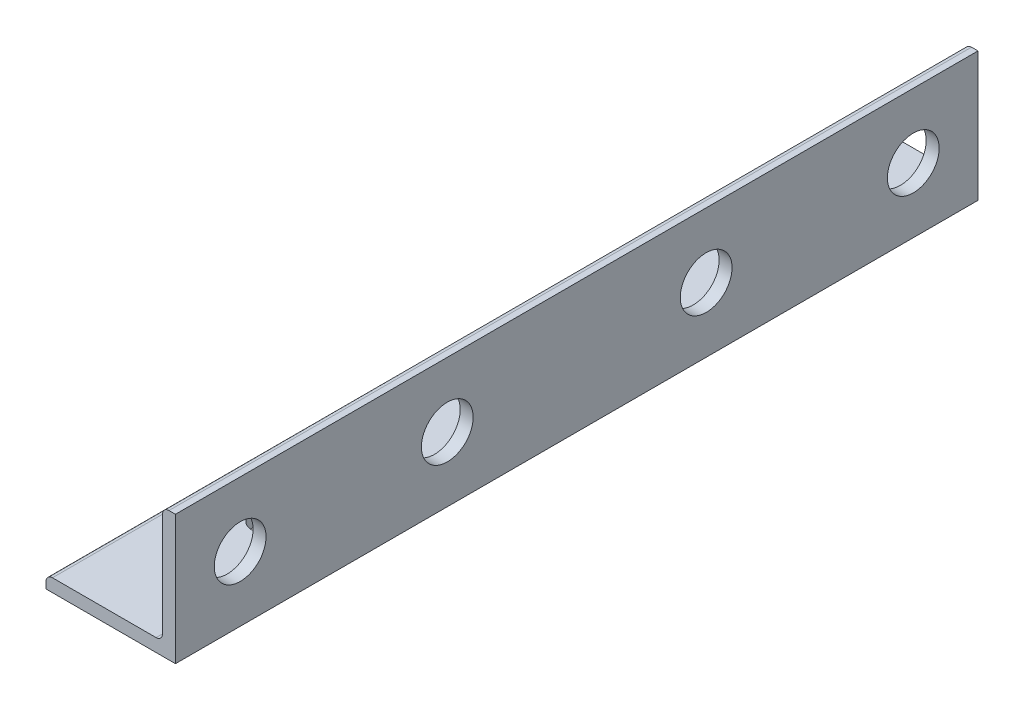
ISO-10303-21;
HEADER;
FILE_DESCRIPTION(('STEP AP214'),'2;1');
FILE_NAME('part.step','',(''),(''),'','','');
FILE_SCHEMA(('AUTOMOTIVE_DESIGN { 1 0 10303 214 1 1 1 1 }'));
ENDSEC;
DATA;
#1=APPLICATION_CONTEXT('core data for automotive mechanical design processes');
#2=APPLICATION_PROTOCOL_DEFINITION('international standard','automotive_design',2000,#1);
#3=PRODUCT_CONTEXT('',#1,'mechanical');
#4=PRODUCT('Part','Part','',(#3));
#5=PRODUCT_RELATED_PRODUCT_CATEGORY('part','',(#4));
#6=PRODUCT_DEFINITION_FORMATION('','',#4);
#7=PRODUCT_DEFINITION_CONTEXT('part definition',#1,'design');
#8=PRODUCT_DEFINITION('design','',#6,#7);
#9=PRODUCT_DEFINITION_SHAPE('','',#8);
#10=(LENGTH_UNIT() NAMED_UNIT(*) SI_UNIT(.MILLI.,.METRE.));
#11=(NAMED_UNIT(*) PLANE_ANGLE_UNIT() SI_UNIT($,.RADIAN.));
#12=(NAMED_UNIT(*) SI_UNIT($,.STERADIAN.) SOLID_ANGLE_UNIT());
#13=UNCERTAINTY_MEASURE_WITH_UNIT(LENGTH_MEASURE(1.E-05),#10,'distance_accuracy_value','');
#14=(GEOMETRIC_REPRESENTATION_CONTEXT(3) GLOBAL_UNCERTAINTY_ASSIGNED_CONTEXT((#13)) GLOBAL_UNIT_ASSIGNED_CONTEXT((#10,
#11,#12)) REPRESENTATION_CONTEXT('',''));
#15=CARTESIAN_POINT('',(0.,0.,0.));
#16=DIRECTION('',(0.,0.,1.));
#17=DIRECTION('',(1.,0.,0.));
#18=AXIS2_PLACEMENT_3D('',#15,#16,#17);
#19=CARTESIAN_POINT('',(-7.9375,0.793749999999998,49.2125));
#20=DIRECTION('',(1.,0.,0.));
#21=DIRECTION('',(0.,0.,-1.));
#22=AXIS2_PLACEMENT_3D('',#19,#20,#21);
#23=PLANE('',#22);
#24=DIRECTION('',(0.,-1.,0.));
#25=VECTOR('',#24,1.);
#26=CARTESIAN_POINT('',(-7.9375,0.793749999999998,-49.2125));
#27=LINE('',#26,#25);
#28=CARTESIAN_POINT('',(-7.9375,0.793749999999999,-49.2125));
#29=VERTEX_POINT('',#28);
#30=CARTESIAN_POINT('',(-7.9375,0.,-49.2125));
#31=VERTEX_POINT('',#30);
#32=EDGE_CURVE('E137',#29,#31,#27,.T.);
#33=ORIENTED_EDGE('',*,*,#32,.T.);
#34=DIRECTION('',(0.,0.,-1.));
#35=VECTOR('',#34,1.);
#36=CARTESIAN_POINT('',(-7.9375,0.,49.2125));
#37=LINE('',#36,#35);
#38=CARTESIAN_POINT('',(-7.9375,0.,49.2125));
#39=VERTEX_POINT('',#38);
#40=EDGE_CURVE('E11',#39,#31,#37,.T.);
#41=ORIENTED_EDGE('',*,*,#40,.F.);
#42=DIRECTION('',(0.,-1.,0.));
#43=VECTOR('',#42,1.);
#44=CARTESIAN_POINT('',(-7.9375,0.793749999999998,49.2125));
#45=LINE('',#44,#43);
#46=CARTESIAN_POINT('',(-7.9375,0.793749999999999,49.2125));
#47=VERTEX_POINT('',#46);
#48=EDGE_CURVE('E154',#47,#39,#45,.T.);
#49=ORIENTED_EDGE('',*,*,#48,.F.);
#50=DIRECTION('',(0.,0.,-1.));
#51=VECTOR('',#50,1.);
#52=CARTESIAN_POINT('',(-7.9375,0.793749999999999,49.2125));
#53=LINE('',#52,#51);
#54=EDGE_CURVE('E133',#47,#29,#53,.T.);
#55=ORIENTED_EDGE('',*,*,#54,.T.);
#56=EDGE_LOOP('',(#33,#41,#49,#55));
#57=FACE_BOUND('',#56,.T.);
#58=ADVANCED_FACE('F33',(#57),#23,.F.);
#59=CARTESIAN_POINT('',(-7.9375,0.,49.2125));
#60=DIRECTION('',(0.,1.,0.));
#61=DIRECTION('',(0.,0.,1.));
#62=AXIS2_PLACEMENT_3D('',#59,#60,#61);
#63=PLANE('',#62);
#64=CARTESIAN_POINT('',(0.,0.,30.1625));
#65=DIRECTION('',(0.,-1.,0.));
#66=DIRECTION('',(0.,0.,-1.));
#67=AXIS2_PLACEMENT_3D('',#64,#65,#66);
#68=CIRCLE('',#67,1.7500092);
#69=CARTESIAN_POINT('',(0.,0.,28.4124908));
#70=VERTEX_POINT('',#69);
#71=EDGE_CURVE('E182',#70,#70,#68,.T.);
#72=ORIENTED_EDGE('',*,*,#71,.F.);
#73=EDGE_LOOP('',(#72));
#74=FACE_BOUND('',#73,.T.);
#75=CARTESIAN_POINT('',(0.,0.,-30.1625));
#76=DIRECTION('',(0.,-1.,0.));
#77=DIRECTION('',(0.,0.,-1.));
#78=AXIS2_PLACEMENT_3D('',#75,#76,#77);
#79=CIRCLE('',#78,1.7500092);
#80=CARTESIAN_POINT('',(0.,0.,-31.9125092));
#81=VERTEX_POINT('',#80);
#82=EDGE_CURVE('E188',#81,#81,#79,.T.);
#83=ORIENTED_EDGE('',*,*,#82,.F.);
#84=EDGE_LOOP('',(#83));
#85=FACE_BOUND('',#84,.T.);
#86=DIRECTION('',(1.,0.,0.));
#87=VECTOR('',#86,1.);
#88=CARTESIAN_POINT('',(-7.9375,0.,-49.2125));
#89=LINE('',#88,#87);
#90=CARTESIAN_POINT('',(7.9375,0.,-49.2125));
#91=VERTEX_POINT('',#90);
#92=EDGE_CURVE('E140',#31,#91,#89,.T.);
#93=ORIENTED_EDGE('',*,*,#92,.T.);
#94=DIRECTION('',(0.,0.,-1.));
#95=VECTOR('',#94,1.);
#96=CARTESIAN_POINT('',(7.9375,0.,49.2125));
#97=LINE('',#96,#95);
#98=CARTESIAN_POINT('',(7.9375,0.,49.2125));
#99=VERTEX_POINT('',#98);
#100=EDGE_CURVE('E42',#99,#91,#97,.T.);
#101=ORIENTED_EDGE('',*,*,#100,.F.);
#102=DIRECTION('',(1.,0.,0.));
#103=VECTOR('',#102,1.);
#104=CARTESIAN_POINT('',(-7.9375,0.,49.2125));
#105=LINE('',#104,#103);
#106=EDGE_CURVE('E97',#39,#99,#105,.T.);
#107=ORIENTED_EDGE('',*,*,#106,.F.);
#108=ORIENTED_EDGE('',*,*,#40,.T.);
#109=EDGE_LOOP('',(#93,#101,#107,#108));
#110=FACE_BOUND('',#109,.T.);
#111=ADVANCED_FACE('F241',(#74,#85,#110),#63,.F.);
#112=CARTESIAN_POINT('',(7.9375,0.,49.2125));
#113=DIRECTION('',(-1.,0.,0.));
#114=DIRECTION('',(0.,0.,1.));
#115=AXIS2_PLACEMENT_3D('',#112,#113,#114);
#116=PLANE('',#115);
#117=CARTESIAN_POINT('',(7.9375,7.93749999999999,41.275));
#118=DIRECTION('',(1.,0.,0.));
#119=DIRECTION('',(0.,0.,-1.));
#120=AXIS2_PLACEMENT_3D('',#117,#118,#119);
#121=CIRCLE('',#120,3.175);
#122=CARTESIAN_POINT('',(7.9375,7.93749999999999,38.1));
#123=VERTEX_POINT('',#122);
#124=EDGE_CURVE('E173',#123,#123,#121,.T.);
#125=ORIENTED_EDGE('',*,*,#124,.F.);
#126=EDGE_LOOP('',(#125));
#127=FACE_BOUND('',#126,.T.);
#128=CARTESIAN_POINT('',(7.9375,7.93749999999999,-15.875));
#129=DIRECTION('',(1.,0.,0.));
#130=DIRECTION('',(0.,0.,-1.));
#131=AXIS2_PLACEMENT_3D('',#128,#129,#130);
#132=CIRCLE('',#131,3.175);
#133=CARTESIAN_POINT('',(7.9375,7.93749999999999,-19.05));
#134=VERTEX_POINT('',#133);
#135=EDGE_CURVE('E186',#134,#134,#132,.T.);
#136=ORIENTED_EDGE('',*,*,#135,.F.);
#137=EDGE_LOOP('',(#136));
#138=FACE_BOUND('',#137,.T.);
#139=CARTESIAN_POINT('',(7.9375,7.93749999999999,15.875));
#140=DIRECTION('',(1.,0.,0.));
#141=DIRECTION('',(0.,0.,-1.));
#142=AXIS2_PLACEMENT_3D('',#139,#140,#141);
#143=CIRCLE('',#142,3.175);
#144=CARTESIAN_POINT('',(7.9375,7.93749999999999,12.7));
#145=VERTEX_POINT('',#144);
#146=EDGE_CURVE('E200',#145,#145,#143,.T.);
#147=ORIENTED_EDGE('',*,*,#146,.F.);
#148=EDGE_LOOP('',(#147));
#149=FACE_BOUND('',#148,.T.);
#150=CARTESIAN_POINT('',(7.9375,7.93749999999999,-41.275));
#151=DIRECTION('',(1.,0.,0.));
#152=DIRECTION('',(0.,0.,-1.));
#153=AXIS2_PLACEMENT_3D('',#150,#151,#152);
#154=CIRCLE('',#153,3.175);
#155=CARTESIAN_POINT('',(7.9375,7.93749999999999,-44.45));
#156=VERTEX_POINT('',#155);
#157=EDGE_CURVE('E197',#156,#156,#154,.T.);
#158=ORIENTED_EDGE('',*,*,#157,.F.);
#159=EDGE_LOOP('',(#158));
#160=FACE_BOUND('',#159,.T.);
#161=DIRECTION('',(0.,1.,0.));
#162=VECTOR('',#161,1.);
#163=CARTESIAN_POINT('',(7.9375,0.,-49.2125));
#164=LINE('',#163,#162);
#165=CARTESIAN_POINT('',(7.9375,15.875,-49.2125));
#166=VERTEX_POINT('',#165);
#167=EDGE_CURVE('E143',#91,#166,#164,.T.);
#168=ORIENTED_EDGE('',*,*,#167,.T.);
#169=DIRECTION('',(0.,0.,-1.));
#170=VECTOR('',#169,1.);
#171=CARTESIAN_POINT('',(7.9375,15.875,49.2125));
#172=LINE('',#171,#170);
#173=CARTESIAN_POINT('',(7.9375,15.875,49.2125));
#174=VERTEX_POINT('',#173);
#175=EDGE_CURVE('E164',#174,#166,#172,.T.);
#176=ORIENTED_EDGE('',*,*,#175,.F.);
#177=DIRECTION('',(0.,1.,0.));
#178=VECTOR('',#177,1.);
#179=CARTESIAN_POINT('',(7.9375,0.,49.2125));
#180=LINE('',#179,#178);
#181=EDGE_CURVE('E207',#99,#174,#180,.T.);
#182=ORIENTED_EDGE('',*,*,#181,.F.);
#183=ORIENTED_EDGE('',*,*,#100,.T.);
#184=EDGE_LOOP('',(#168,#176,#182,#183));
#185=FACE_BOUND('',#184,.T.);
#186=ADVANCED_FACE('F245',(#127,#138,#149,#160,#185),#116,.F.);
#187=CARTESIAN_POINT('',(7.14375,15.875,49.2125));
#188=DIRECTION('',(0.,-1.,0.));
#189=DIRECTION('',(1.,0.,0.));
#190=AXIS2_PLACEMENT_3D('',#187,#188,#189);
#191=PLANE('',#190);
#192=DIRECTION('',(-1.,0.,0.));
#193=VECTOR('',#192,1.);
#194=CARTESIAN_POINT('',(7.14375,15.875,-49.2125));
#195=LINE('',#194,#193);
#196=CARTESIAN_POINT('',(7.14375,15.875,-49.2125));
#197=VERTEX_POINT('',#196);
#198=EDGE_CURVE('E145',#166,#197,#195,.T.);
#199=ORIENTED_EDGE('',*,*,#198,.T.);
#200=DIRECTION('',(0.,0.,-1.));
#201=VECTOR('',#200,1.);
#202=CARTESIAN_POINT('',(7.14375,15.875,49.2125));
#203=LINE('',#202,#201);
#204=CARTESIAN_POINT('',(7.14375,15.875,49.2125));
#205=VERTEX_POINT('',#204);
#206=EDGE_CURVE('E161',#205,#197,#203,.T.);
#207=ORIENTED_EDGE('',*,*,#206,.F.);
#208=DIRECTION('',(-1.,0.,0.));
#209=VECTOR('',#208,1.);
#210=CARTESIAN_POINT('',(7.14375,15.875,49.2125));
#211=LINE('',#210,#209);
#212=EDGE_CURVE('E209',#174,#205,#211,.T.);
#213=ORIENTED_EDGE('',*,*,#212,.F.);
#214=ORIENTED_EDGE('',*,*,#175,.T.);
#215=EDGE_LOOP('',(#199,#207,#213,#214));
#216=FACE_BOUND('',#215,.T.);
#217=ADVANCED_FACE('F250',(#216),#191,.F.);
#218=CARTESIAN_POINT('',(7.14375,15.08125,49.2125));
#219=DIRECTION('',(0.,0.,-1.));
#220=DIRECTION('',(-1.,0.,0.));
#221=AXIS2_PLACEMENT_3D('',#218,#219,#220);
#222=CYLINDRICAL_SURFACE('',#221,0.793749999999998);
#223=CARTESIAN_POINT('',(7.14375,15.08125,-49.2125));
#224=DIRECTION('',(0.,0.,1.));
#225=DIRECTION('',(-1.,0.,0.));
#226=AXIS2_PLACEMENT_3D('',#223,#224,#225);
#227=CIRCLE('',#226,0.793749999999998);
#228=CARTESIAN_POINT('',(6.35,15.08125,-49.2125));
#229=VERTEX_POINT('',#228);
#230=EDGE_CURVE('E147',#197,#229,#227,.T.);
#231=ORIENTED_EDGE('',*,*,#230,.T.);
#232=DIRECTION('',(0.,0.,-1.));
#233=VECTOR('',#232,1.);
#234=CARTESIAN_POINT('',(6.35,15.08125,49.2125));
#235=LINE('',#234,#233);
#236=CARTESIAN_POINT('',(6.35,15.08125,49.2125));
#237=VERTEX_POINT('',#236);
#238=EDGE_CURVE('E158',#237,#229,#235,.T.);
#239=ORIENTED_EDGE('',*,*,#238,.F.);
#240=CARTESIAN_POINT('',(7.14375,15.08125,49.2125));
#241=DIRECTION('',(0.,0.,1.));
#242=DIRECTION('',(-1.,0.,0.));
#243=AXIS2_PLACEMENT_3D('',#240,#241,#242);
#244=CIRCLE('',#243,0.793749999999998);
#245=EDGE_CURVE('E211',#205,#237,#244,.T.);
#246=ORIENTED_EDGE('',*,*,#245,.F.);
#247=ORIENTED_EDGE('',*,*,#206,.T.);
#248=EDGE_LOOP('',(#231,#239,#246,#247));
#249=FACE_BOUND('',#248,.T.);
#250=ADVANCED_FACE('F217',(#249),#222,.T.);
#251=CARTESIAN_POINT('',(6.35,15.08125,49.2125));
#252=DIRECTION('',(1.,0.,0.));
#253=DIRECTION('',(0.,1.,0.));
#254=AXIS2_PLACEMENT_3D('',#251,#252,#253);
#255=PLANE('',#254);
#256=CARTESIAN_POINT('',(6.35,7.93749999999999,41.275));
#257=DIRECTION('',(1.,0.,0.));
#258=DIRECTION('',(0.,1.,0.));
#259=AXIS2_PLACEMENT_3D('',#256,#257,#258);
#260=CIRCLE('',#259,3.175);
#261=CARTESIAN_POINT('',(6.35,11.1125,41.275));
#262=VERTEX_POINT('',#261);
#263=EDGE_CURVE('E141',#262,#262,#260,.T.);
#264=ORIENTED_EDGE('',*,*,#263,.T.);
#265=EDGE_LOOP('',(#264));
#266=FACE_BOUND('',#265,.T.);
#267=CARTESIAN_POINT('',(6.35,7.93749999999999,-15.875));
#268=DIRECTION('',(1.,0.,0.));
#269=DIRECTION('',(0.,1.,0.));
#270=AXIS2_PLACEMENT_3D('',#267,#268,#269);
#271=CIRCLE('',#270,3.175);
#272=CARTESIAN_POINT('',(6.35,11.1125,-15.875));
#273=VERTEX_POINT('',#272);
#274=EDGE_CURVE('E176',#273,#273,#271,.T.);
#275=ORIENTED_EDGE('',*,*,#274,.T.);
#276=EDGE_LOOP('',(#275));
#277=FACE_BOUND('',#276,.T.);
#278=CARTESIAN_POINT('',(6.35,7.93749999999999,15.875));
#279=DIRECTION('',(1.,0.,0.));
#280=DIRECTION('',(0.,1.,0.));
#281=AXIS2_PLACEMENT_3D('',#278,#279,#280);
#282=CIRCLE('',#281,3.175);
#283=CARTESIAN_POINT('',(6.35,11.1125,15.875));
#284=VERTEX_POINT('',#283);
#285=EDGE_CURVE('E172',#284,#284,#282,.T.);
#286=ORIENTED_EDGE('',*,*,#285,.T.);
#287=EDGE_LOOP('',(#286));
#288=FACE_BOUND('',#287,.T.);
#289=CARTESIAN_POINT('',(6.35,7.93749999999999,-41.275));
#290=DIRECTION('',(1.,0.,0.));
#291=DIRECTION('',(0.,1.,0.));
#292=AXIS2_PLACEMENT_3D('',#289,#290,#291);
#293=CIRCLE('',#292,3.175);
#294=CARTESIAN_POINT('',(6.35,11.1125,-41.275));
#295=VERTEX_POINT('',#294);
#296=EDGE_CURVE('E169',#295,#295,#293,.T.);
#297=ORIENTED_EDGE('',*,*,#296,.T.);
#298=EDGE_LOOP('',(#297));
#299=FACE_BOUND('',#298,.T.);
#300=DIRECTION('',(0.,-1.,0.));
#301=VECTOR('',#300,1.);
#302=CARTESIAN_POINT('',(6.35,15.08125,-49.2125));
#303=LINE('',#302,#301);
#304=CARTESIAN_POINT('',(6.35,2.38124999999999,-49.2125));
#305=VERTEX_POINT('',#304);
#306=EDGE_CURVE('E149',#229,#305,#303,.T.);
#307=ORIENTED_EDGE('',*,*,#306,.T.);
#308=DIRECTION('',(0.,0.,-1.));
#309=VECTOR('',#308,1.);
#310=CARTESIAN_POINT('',(6.35,2.38124999999999,49.2125));
#311=LINE('',#310,#309);
#312=CARTESIAN_POINT('',(6.35,2.38124999999999,49.2125));
#313=VERTEX_POINT('',#312);
#314=EDGE_CURVE('E128',#313,#305,#311,.T.);
#315=ORIENTED_EDGE('',*,*,#314,.F.);
#316=DIRECTION('',(0.,-1.,0.));
#317=VECTOR('',#316,1.);
#318=CARTESIAN_POINT('',(6.35,15.08125,49.2125));
#319=LINE('',#318,#317);
#320=EDGE_CURVE('E119',#237,#313,#319,.T.);
#321=ORIENTED_EDGE('',*,*,#320,.F.);
#322=ORIENTED_EDGE('',*,*,#238,.T.);
#323=EDGE_LOOP('',(#307,#315,#321,#322));
#324=FACE_BOUND('',#323,.T.);
#325=ADVANCED_FACE('F221',(#266,#277,#288,#299,#324),#255,.F.);
#326=CARTESIAN_POINT('',(5.55625000000001,2.38124999999999,49.2125));
#327=DIRECTION('',(0.,0.,-1.));
#328=DIRECTION('',(-1.,0.,0.));
#329=AXIS2_PLACEMENT_3D('',#326,#327,#328);
#330=CYLINDRICAL_SURFACE('',#329,0.793749999999998);
#331=CARTESIAN_POINT('',(5.55625000000001,2.38124999999999,-49.2125));
#332=DIRECTION('',(0.,0.,-1.));
#333=DIRECTION('',(-1.,0.,0.));
#334=AXIS2_PLACEMENT_3D('',#331,#332,#333);
#335=CIRCLE('',#334,0.793749999999998);
#336=CARTESIAN_POINT('',(5.55625000000001,1.5875,-49.2125));
#337=VERTEX_POINT('',#336);
#338=EDGE_CURVE('E127',#305,#337,#335,.T.);
#339=ORIENTED_EDGE('',*,*,#338,.T.);
#340=DIRECTION('',(0.,0.,-1.));
#341=VECTOR('',#340,1.);
#342=CARTESIAN_POINT('',(5.55625000000001,1.5875,49.2125));
#343=LINE('',#342,#341);
#344=CARTESIAN_POINT('',(5.55625000000001,1.5875,49.2125));
#345=VERTEX_POINT('',#344);
#346=EDGE_CURVE('E124',#345,#337,#343,.T.);
#347=ORIENTED_EDGE('',*,*,#346,.F.);
#348=CARTESIAN_POINT('',(5.55625000000001,2.38124999999999,49.2125));
#349=DIRECTION('',(0.,0.,-1.));
#350=DIRECTION('',(-1.,0.,0.));
#351=AXIS2_PLACEMENT_3D('',#348,#349,#350);
#352=CIRCLE('',#351,0.793749999999998);
#353=EDGE_CURVE('E113',#313,#345,#352,.T.);
#354=ORIENTED_EDGE('',*,*,#353,.F.);
#355=ORIENTED_EDGE('',*,*,#314,.T.);
#356=EDGE_LOOP('',(#339,#347,#354,#355));
#357=FACE_BOUND('',#356,.T.);
#358=ADVANCED_FACE('F125',(#357),#330,.F.);
#359=CARTESIAN_POINT('',(5.55625000000001,1.5875,49.2125));
#360=DIRECTION('',(0.,-1.,0.));
#361=DIRECTION('',(1.,0.,0.));
#362=AXIS2_PLACEMENT_3D('',#359,#360,#361);
#363=PLANE('',#362);
#364=CARTESIAN_POINT('',(0.,1.5875,30.1625));
#365=DIRECTION('',(0.,-1.,0.));
#366=DIRECTION('',(1.,0.,0.));
#367=AXIS2_PLACEMENT_3D('',#364,#365,#366);
#368=CIRCLE('',#367,1.7500092);
#369=CARTESIAN_POINT('',(1.7500092,1.5875,30.1625));
#370=VERTEX_POINT('',#369);
#371=EDGE_CURVE('E36',#370,#370,#368,.T.);
#372=ORIENTED_EDGE('',*,*,#371,.T.);
#373=EDGE_LOOP('',(#372));
#374=FACE_BOUND('',#373,.T.);
#375=CARTESIAN_POINT('',(0.,1.5875,-30.1625));
#376=DIRECTION('',(0.,-1.,0.));
#377=DIRECTION('',(1.,0.,0.));
#378=AXIS2_PLACEMENT_3D('',#375,#376,#377);
#379=CIRCLE('',#378,1.7500092);
#380=CARTESIAN_POINT('',(1.7500092,1.5875,-30.1625));
#381=VERTEX_POINT('',#380);
#382=EDGE_CURVE('E180',#381,#381,#379,.T.);
#383=ORIENTED_EDGE('',*,*,#382,.T.);
#384=EDGE_LOOP('',(#383));
#385=FACE_BOUND('',#384,.T.);
#386=DIRECTION('',(-1.,0.,0.));
#387=VECTOR('',#386,1.);
#388=CARTESIAN_POINT('',(5.55625000000001,1.5875,-49.2125));
#389=LINE('',#388,#387);
#390=CARTESIAN_POINT('',(-7.14375,1.5875,-49.2125));
#391=VERTEX_POINT('',#390);
#392=EDGE_CURVE('E83',#337,#391,#389,.T.);
#393=ORIENTED_EDGE('',*,*,#392,.T.);
#394=DIRECTION('',(0.,0.,-1.));
#395=VECTOR('',#394,1.);
#396=CARTESIAN_POINT('',(-7.14375,1.5875,49.2125));
#397=LINE('',#396,#395);
#398=CARTESIAN_POINT('',(-7.14375,1.5875,49.2125));
#399=VERTEX_POINT('',#398);
#400=EDGE_CURVE('E129',#399,#391,#397,.T.);
#401=ORIENTED_EDGE('',*,*,#400,.F.);
#402=DIRECTION('',(-1.,0.,0.));
#403=VECTOR('',#402,1.);
#404=CARTESIAN_POINT('',(5.55625000000001,1.5875,49.2125));
#405=LINE('',#404,#403);
#406=EDGE_CURVE('E117',#345,#399,#405,.T.);
#407=ORIENTED_EDGE('',*,*,#406,.F.);
#408=ORIENTED_EDGE('',*,*,#346,.T.);
#409=EDGE_LOOP('',(#393,#401,#407,#408));
#410=FACE_BOUND('',#409,.T.);
#411=ADVANCED_FACE('F131',(#374,#385,#410),#363,.F.);
#412=CARTESIAN_POINT('',(-7.14375,0.793749999999999,49.2125));
#413=DIRECTION('',(0.,0.,-1.));
#414=DIRECTION('',(-1.,0.,0.));
#415=AXIS2_PLACEMENT_3D('',#412,#413,#414);
#416=CYLINDRICAL_SURFACE('',#415,0.793749999999999);
#417=CARTESIAN_POINT('',(-7.14375,0.793749999999999,-49.2125));
#418=DIRECTION('',(0.,0.,1.));
#419=DIRECTION('',(-1.,0.,0.));
#420=AXIS2_PLACEMENT_3D('',#417,#418,#419);
#421=CIRCLE('',#420,0.793749999999999);
#422=EDGE_CURVE('E89',#391,#29,#421,.T.);
#423=ORIENTED_EDGE('',*,*,#422,.T.);
#424=ORIENTED_EDGE('',*,*,#54,.F.);
#425=CARTESIAN_POINT('',(-7.14375,0.793749999999999,49.2125));
#426=DIRECTION('',(0.,0.,1.));
#427=DIRECTION('',(-1.,0.,0.));
#428=AXIS2_PLACEMENT_3D('',#425,#426,#427);
#429=CIRCLE('',#428,0.793749999999999);
#430=EDGE_CURVE('E51',#399,#47,#429,.T.);
#431=ORIENTED_EDGE('',*,*,#430,.F.);
#432=ORIENTED_EDGE('',*,*,#400,.T.);
#433=EDGE_LOOP('',(#423,#424,#431,#432));
#434=FACE_BOUND('',#433,.T.);
#435=ADVANCED_FACE('F229',(#434),#416,.T.);
#436=CARTESIAN_POINT('',(7.14375,15.08125,49.2125));
#437=DIRECTION('',(0.,0.,-1.));
#438=DIRECTION('',(-1.,0.,0.));
#439=AXIS2_PLACEMENT_3D('',#436,#437,#438);
#440=PLANE('',#439);
#441=ORIENTED_EDGE('',*,*,#48,.T.);
#442=ORIENTED_EDGE('',*,*,#106,.T.);
#443=ORIENTED_EDGE('',*,*,#181,.T.);
#444=ORIENTED_EDGE('',*,*,#212,.T.);
#445=ORIENTED_EDGE('',*,*,#245,.T.);
#446=ORIENTED_EDGE('',*,*,#320,.T.);
#447=ORIENTED_EDGE('',*,*,#353,.T.);
#448=ORIENTED_EDGE('',*,*,#406,.T.);
#449=ORIENTED_EDGE('',*,*,#430,.T.);
#450=EDGE_LOOP('',(#441,#442,#443,#444,#445,#446,#447,#448,#449));
#451=FACE_BOUND('',#450,.T.);
#452=ADVANCED_FACE('F115',(#451),#440,.F.);
#453=CARTESIAN_POINT('',(7.14375,15.08125,-49.2125));
#454=DIRECTION('',(0.,0.,-1.));
#455=DIRECTION('',(-1.,0.,0.));
#456=AXIS2_PLACEMENT_3D('',#453,#454,#455);
#457=PLANE('',#456);
#458=ORIENTED_EDGE('',*,*,#32,.F.);
#459=ORIENTED_EDGE('',*,*,#422,.F.);
#460=ORIENTED_EDGE('',*,*,#392,.F.);
#461=ORIENTED_EDGE('',*,*,#338,.F.);
#462=ORIENTED_EDGE('',*,*,#306,.F.);
#463=ORIENTED_EDGE('',*,*,#230,.F.);
#464=ORIENTED_EDGE('',*,*,#198,.F.);
#465=ORIENTED_EDGE('',*,*,#167,.F.);
#466=ORIENTED_EDGE('',*,*,#92,.F.);
#467=EDGE_LOOP('',(#458,#459,#460,#461,#462,#463,#464,#465,#466));
#468=FACE_BOUND('',#467,.T.);
#469=ADVANCED_FACE('F224',(#468),#457,.T.);
#470=CARTESIAN_POINT('',(-7.9375,7.93749999999999,-41.275));
#471=DIRECTION('',(1.,0.,0.));
#472=DIRECTION('',(0.,0.,-1.));
#473=AXIS2_PLACEMENT_3D('',#470,#471,#472);
#474=CYLINDRICAL_SURFACE('',#473,3.175);
#475=ORIENTED_EDGE('',*,*,#157,.T.);
#476=EDGE_LOOP('',(#475));
#477=FACE_BOUND('',#476,.T.);
#478=ORIENTED_EDGE('',*,*,#296,.F.);
#479=EDGE_LOOP('',(#478));
#480=FACE_BOUND('',#479,.T.);
#481=ADVANCED_FACE('F312',(#477,#480),#474,.F.);
#482=CARTESIAN_POINT('',(-7.9375,7.93749999999999,15.875));
#483=DIRECTION('',(1.,0.,0.));
#484=DIRECTION('',(0.,0.,-1.));
#485=AXIS2_PLACEMENT_3D('',#482,#483,#484);
#486=CYLINDRICAL_SURFACE('',#485,3.175);
#487=ORIENTED_EDGE('',*,*,#146,.T.);
#488=EDGE_LOOP('',(#487));
#489=FACE_BOUND('',#488,.T.);
#490=ORIENTED_EDGE('',*,*,#285,.F.);
#491=EDGE_LOOP('',(#490));
#492=FACE_BOUND('',#491,.T.);
#493=ADVANCED_FACE('F310',(#489,#492),#486,.F.);
#494=CARTESIAN_POINT('',(-7.9375,7.93749999999999,-15.875));
#495=DIRECTION('',(1.,0.,0.));
#496=DIRECTION('',(0.,0.,-1.));
#497=AXIS2_PLACEMENT_3D('',#494,#495,#496);
#498=CYLINDRICAL_SURFACE('',#497,3.175);
#499=ORIENTED_EDGE('',*,*,#135,.T.);
#500=EDGE_LOOP('',(#499));
#501=FACE_BOUND('',#500,.T.);
#502=ORIENTED_EDGE('',*,*,#274,.F.);
#503=EDGE_LOOP('',(#502));
#504=FACE_BOUND('',#503,.T.);
#505=ADVANCED_FACE('F306',(#501,#504),#498,.F.);
#506=CARTESIAN_POINT('',(-7.9375,7.93749999999999,41.275));
#507=DIRECTION('',(1.,0.,0.));
#508=DIRECTION('',(0.,0.,-1.));
#509=AXIS2_PLACEMENT_3D('',#506,#507,#508);
#510=CYLINDRICAL_SURFACE('',#509,3.175);
#511=ORIENTED_EDGE('',*,*,#124,.T.);
#512=EDGE_LOOP('',(#511));
#513=FACE_BOUND('',#512,.T.);
#514=ORIENTED_EDGE('',*,*,#263,.F.);
#515=EDGE_LOOP('',(#514));
#516=FACE_BOUND('',#515,.T.);
#517=ADVANCED_FACE('F288',(#513,#516),#510,.F.);
#518=CARTESIAN_POINT('',(0.,15.875,-30.1625));
#519=DIRECTION('',(0.,-1.,0.));
#520=DIRECTION('',(0.,0.,-1.));
#521=AXIS2_PLACEMENT_3D('',#518,#519,#520);
#522=CYLINDRICAL_SURFACE('',#521,1.7500092);
#523=ORIENTED_EDGE('',*,*,#82,.T.);
#524=EDGE_LOOP('',(#523));
#525=FACE_BOUND('',#524,.T.);
#526=ORIENTED_EDGE('',*,*,#382,.F.);
#527=EDGE_LOOP('',(#526));
#528=FACE_BOUND('',#527,.T.);
#529=ADVANCED_FACE('F282',(#525,#528),#522,.F.);
#530=CARTESIAN_POINT('',(0.,15.875,30.1625));
#531=DIRECTION('',(0.,-1.,0.));
#532=DIRECTION('',(0.,0.,-1.));
#533=AXIS2_PLACEMENT_3D('',#530,#531,#532);
#534=CYLINDRICAL_SURFACE('',#533,1.7500092);
#535=ORIENTED_EDGE('',*,*,#71,.T.);
#536=EDGE_LOOP('',(#535));
#537=FACE_BOUND('',#536,.T.);
#538=ORIENTED_EDGE('',*,*,#371,.F.);
#539=EDGE_LOOP('',(#538));
#540=FACE_BOUND('',#539,.T.);
#541=ADVANCED_FACE('F287',(#537,#540),#534,.F.);
#542=CLOSED_SHELL('',(#58,#111,#186,#217,#250,#325,#358,#411,#435,#452,#469,#481,#493,#505,#517,
#529,#541));
#543=MANIFOLD_SOLID_BREP('B2',#542);
#544=ADVANCED_BREP_SHAPE_REPRESENTATION('',(#18,#543),#14);
#545=SHAPE_DEFINITION_REPRESENTATION(#9,#544);
ENDSEC;
END-ISO-10303-21;
